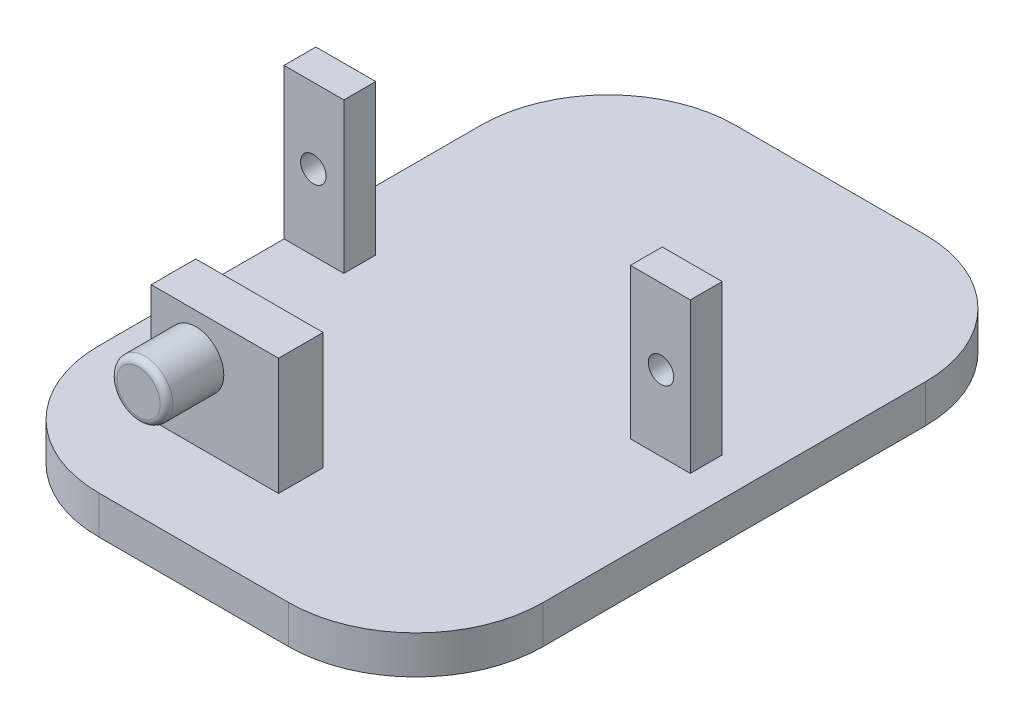
ISO-10303-21;
HEADER;
FILE_DESCRIPTION(('STEP AP214'),'2;1');
FILE_NAME('part.step','',(''),(''),'','','');
FILE_SCHEMA(('AUTOMOTIVE_DESIGN { 1 0 10303 214 1 1 1 1 }'));
ENDSEC;
DATA;
#1=APPLICATION_CONTEXT('core data for automotive mechanical design processes');
#2=APPLICATION_PROTOCOL_DEFINITION('international standard','automotive_design',2000,#1);
#3=PRODUCT_CONTEXT('',#1,'mechanical');
#4=PRODUCT('Part','Part','',(#3));
#5=PRODUCT_RELATED_PRODUCT_CATEGORY('part','',(#4));
#6=PRODUCT_DEFINITION_FORMATION('','',#4);
#7=PRODUCT_DEFINITION_CONTEXT('part definition',#1,'design');
#8=PRODUCT_DEFINITION('design','',#6,#7);
#9=PRODUCT_DEFINITION_SHAPE('','',#8);
#10=(LENGTH_UNIT() NAMED_UNIT(*) SI_UNIT(.MILLI.,.METRE.));
#11=(NAMED_UNIT(*) PLANE_ANGLE_UNIT() SI_UNIT($,.RADIAN.));
#12=(NAMED_UNIT(*) SI_UNIT($,.STERADIAN.) SOLID_ANGLE_UNIT());
#13=UNCERTAINTY_MEASURE_WITH_UNIT(LENGTH_MEASURE(1.E-05),#10,'distance_accuracy_value','');
#14=(GEOMETRIC_REPRESENTATION_CONTEXT(3) GLOBAL_UNCERTAINTY_ASSIGNED_CONTEXT((#13)) GLOBAL_UNIT_ASSIGNED_CONTEXT((#10,
#11,#12)) REPRESENTATION_CONTEXT('',''));
#15=CARTESIAN_POINT('',(0.,0.,0.));
#16=DIRECTION('',(0.,0.,1.));
#17=DIRECTION('',(1.,0.,0.));
#18=AXIS2_PLACEMENT_3D('',#15,#16,#17);
#19=CARTESIAN_POINT('',(0.,3.,-50.));
#20=DIRECTION('',(0.,-1.,0.));
#21=DIRECTION('',(0.,0.,1.));
#22=AXIS2_PLACEMENT_3D('',#19,#20,#21);
#23=PLANE('',#22);
#24=DIRECTION('',(0.,0.,1.));
#25=VECTOR('',#24,1.);
#26=CARTESIAN_POINT('',(27.2,3.,-27.05));
#27=LINE('',#26,#25);
#28=CARTESIAN_POINT('',(27.2,3.,-27.05));
#29=VERTEX_POINT('',#28);
#30=CARTESIAN_POINT('',(27.2,3.,-24.55));
#31=VERTEX_POINT('',#30);
#32=EDGE_CURVE('E178',#29,#31,#27,.T.);
#33=ORIENTED_EDGE('',*,*,#32,.F.);
#34=DIRECTION('',(1.,0.,0.));
#35=VECTOR('',#34,1.);
#36=CARTESIAN_POINT('',(27.2,3.,-27.05));
#37=LINE('',#36,#35);
#38=CARTESIAN_POINT('',(31.9,3.,-27.05));
#39=VERTEX_POINT('',#38);
#40=EDGE_CURVE('E197',#29,#39,#37,.T.);
#41=ORIENTED_EDGE('',*,*,#40,.T.);
#42=DIRECTION('',(0.,0.,1.));
#43=VECTOR('',#42,1.);
#44=CARTESIAN_POINT('',(31.9,3.,-27.05));
#45=LINE('',#44,#43);
#46=CARTESIAN_POINT('',(31.9,3.,-24.55));
#47=VERTEX_POINT('',#46);
#48=EDGE_CURVE('E208',#39,#47,#45,.T.);
#49=ORIENTED_EDGE('',*,*,#48,.T.);
#50=DIRECTION('',(1.,0.,0.));
#51=VECTOR('',#50,1.);
#52=CARTESIAN_POINT('',(27.2,3.,-24.55));
#53=LINE('',#52,#51);
#54=EDGE_CURVE('E191',#31,#47,#53,.T.);
#55=ORIENTED_EDGE('',*,*,#54,.F.);
#56=EDGE_LOOP('',(#33,#41,#49,#55));
#57=FACE_BOUND('',#56,.T.);
#58=DIRECTION('',(-1.,0.,0.));
#59=VECTOR('',#58,1.);
#60=CARTESIAN_POINT('',(0.,3.,-50.));
#61=LINE('',#60,#59);
#62=CARTESIAN_POINT('',(24.9,3.,-50.));
#63=VERTEX_POINT('',#62);
#64=CARTESIAN_POINT('',(10.,3.,-50.));
#65=VERTEX_POINT('',#64);
#66=EDGE_CURVE('E273',#63,#65,#61,.T.);
#67=ORIENTED_EDGE('',*,*,#66,.T.);
#68=CARTESIAN_POINT('',(10.,3.,-40.));
#69=DIRECTION('',(0.,1.,0.));
#70=DIRECTION('',(0.,0.,1.));
#71=AXIS2_PLACEMENT_3D('',#68,#69,#70);
#72=CIRCLE('',#71,10.);
#73=CARTESIAN_POINT('',(0.,3.,-40.));
#74=VERTEX_POINT('',#73);
#75=EDGE_CURVE('E307',#74,#65,#72,.F.);
#76=ORIENTED_EDGE('',*,*,#75,.F.);
#77=DIRECTION('',(0.,0.,1.));
#78=VECTOR('',#77,1.);
#79=CARTESIAN_POINT('',(0.,3.,-50.));
#80=LINE('',#79,#78);
#81=CARTESIAN_POINT('',(0.,3.,-27.05));
#82=VERTEX_POINT('',#81);
#83=EDGE_CURVE('E282',#74,#82,#80,.T.);
#84=ORIENTED_EDGE('',*,*,#83,.T.);
#85=DIRECTION('',(-1.,0.,0.));
#86=VECTOR('',#85,1.);
#87=CARTESIAN_POINT('',(4.7,3.,-27.05));
#88=LINE('',#87,#86);
#89=CARTESIAN_POINT('',(4.7,3.,-27.05));
#90=VERTEX_POINT('',#89);
#91=EDGE_CURVE('E212',#90,#82,#88,.T.);
#92=ORIENTED_EDGE('',*,*,#91,.F.);
#93=DIRECTION('',(0.,0.,1.));
#94=VECTOR('',#93,1.);
#95=CARTESIAN_POINT('',(4.7,3.,-27.05));
#96=LINE('',#95,#94);
#97=CARTESIAN_POINT('',(4.7,3.,-24.55));
#98=VERTEX_POINT('',#97);
#99=EDGE_CURVE('E222',#90,#98,#96,.T.);
#100=ORIENTED_EDGE('',*,*,#99,.T.);
#101=DIRECTION('',(-1.,0.,0.));
#102=VECTOR('',#101,1.);
#103=CARTESIAN_POINT('',(4.7,3.,-24.55));
#104=LINE('',#103,#102);
#105=CARTESIAN_POINT('',(0.,3.,-24.55));
#106=VERTEX_POINT('',#105);
#107=EDGE_CURVE('E217',#98,#106,#104,.T.);
#108=ORIENTED_EDGE('',*,*,#107,.T.);
#109=CARTESIAN_POINT('',(0.,3.,-10.));
#110=VERTEX_POINT('',#109);
#111=EDGE_CURVE('E277',#106,#110,#80,.T.);
#112=ORIENTED_EDGE('',*,*,#111,.T.);
#113=CARTESIAN_POINT('',(10.,3.,-10.));
#114=DIRECTION('',(0.,1.,0.));
#115=DIRECTION('',(0.,0.,1.));
#116=AXIS2_PLACEMENT_3D('',#113,#114,#115);
#117=CIRCLE('',#116,10.);
#118=CARTESIAN_POINT('',(10.,3.,0.));
#119=VERTEX_POINT('',#118);
#120=EDGE_CURVE('E310',#119,#110,#117,.F.);
#121=ORIENTED_EDGE('',*,*,#120,.F.);
#122=DIRECTION('',(-1.,0.,0.));
#123=VECTOR('',#122,1.);
#124=CARTESIAN_POINT('',(0.,3.,0.));
#125=LINE('',#124,#123);
#126=CARTESIAN_POINT('',(24.9,3.,0.));
#127=VERTEX_POINT('',#126);
#128=EDGE_CURVE('E274',#127,#119,#125,.T.);
#129=ORIENTED_EDGE('',*,*,#128,.F.);
#130=CARTESIAN_POINT('',(24.9,3.,-10.));
#131=DIRECTION('',(0.,1.,0.));
#132=DIRECTION('',(0.,0.,1.));
#133=AXIS2_PLACEMENT_3D('',#130,#131,#132);
#134=CIRCLE('',#133,10.);
#135=CARTESIAN_POINT('',(34.9,3.,-10.));
#136=VERTEX_POINT('',#135);
#137=EDGE_CURVE('E313',#136,#127,#134,.F.);
#138=ORIENTED_EDGE('',*,*,#137,.F.);
#139=DIRECTION('',(0.,0.,1.));
#140=VECTOR('',#139,1.);
#141=CARTESIAN_POINT('',(34.9,3.,-50.));
#142=LINE('',#141,#140);
#143=CARTESIAN_POINT('',(34.9,3.,-40.));
#144=VERTEX_POINT('',#143);
#145=EDGE_CURVE('E285',#144,#136,#142,.T.);
#146=ORIENTED_EDGE('',*,*,#145,.F.);
#147=CARTESIAN_POINT('',(24.9,3.,-40.));
#148=DIRECTION('',(0.,1.,0.));
#149=DIRECTION('',(0.,0.,1.));
#150=AXIS2_PLACEMENT_3D('',#147,#148,#149);
#151=CIRCLE('',#150,10.);
#152=EDGE_CURVE('E316',#63,#144,#151,.F.);
#153=ORIENTED_EDGE('',*,*,#152,.F.);
#154=EDGE_LOOP('',(#67,#76,#84,#92,#100,#108,#112,#121,#129,#138,#146,#153));
#155=FACE_BOUND('',#154,.T.);
#156=DIRECTION('',(0.,0.,1.));
#157=VECTOR('',#156,1.);
#158=CARTESIAN_POINT('',(17.1,3.,-10.52));
#159=LINE('',#158,#157);
#160=CARTESIAN_POINT('',(17.1,3.,-10.52));
#161=VERTEX_POINT('',#160);
#162=CARTESIAN_POINT('',(17.1,3.,-7.02));
#163=VERTEX_POINT('',#162);
#164=EDGE_CURVE('E225',#161,#163,#159,.T.);
#165=ORIENTED_EDGE('',*,*,#164,.T.);
#166=DIRECTION('',(-1.,0.,0.));
#167=VECTOR('',#166,1.);
#168=CARTESIAN_POINT('',(17.1,3.,-7.02));
#169=LINE('',#168,#167);
#170=CARTESIAN_POINT('',(7.1,3.,-7.02000000000001));
#171=VERTEX_POINT('',#170);
#172=EDGE_CURVE('E254',#163,#171,#169,.T.);
#173=ORIENTED_EDGE('',*,*,#172,.T.);
#174=DIRECTION('',(0.,0.,1.));
#175=VECTOR('',#174,1.);
#176=CARTESIAN_POINT('',(7.1,3.,-10.52));
#177=LINE('',#176,#175);
#178=CARTESIAN_POINT('',(7.1,3.,-10.52));
#179=VERTEX_POINT('',#178);
#180=EDGE_CURVE('E257',#179,#171,#177,.T.);
#181=ORIENTED_EDGE('',*,*,#180,.F.);
#182=DIRECTION('',(-1.,0.,0.));
#183=VECTOR('',#182,1.);
#184=CARTESIAN_POINT('',(17.1,3.,-10.52));
#185=LINE('',#184,#183);
#186=EDGE_CURVE('E244',#161,#179,#185,.T.);
#187=ORIENTED_EDGE('',*,*,#186,.F.);
#188=EDGE_LOOP('',(#165,#173,#181,#187));
#189=FACE_BOUND('',#188,.T.);
#190=ADVANCED_FACE('F35',(#57,#155,#189),#23,.F.);
#191=CARTESIAN_POINT('',(0.,0.,-50.));
#192=DIRECTION('',(1.,0.,0.));
#193=DIRECTION('',(0.,0.,1.));
#194=AXIS2_PLACEMENT_3D('',#191,#192,#193);
#195=PLANE('',#194);
#196=ORIENTED_EDGE('',*,*,#111,.F.);
#197=DIRECTION('',(0.,-1.,0.));
#198=VECTOR('',#197,1.);
#199=CARTESIAN_POINT('',(0.,20.1235326616825,-24.55));
#200=LINE('',#199,#198);
#201=CARTESIAN_POINT('',(0.,14.8,-24.55));
#202=VERTEX_POINT('',#201);
#203=EDGE_CURVE('E235',#202,#106,#200,.T.);
#204=ORIENTED_EDGE('',*,*,#203,.F.);
#205=DIRECTION('',(0.,0.,1.));
#206=VECTOR('',#205,1.);
#207=CARTESIAN_POINT('',(0.,14.8,-27.05));
#208=LINE('',#207,#206);
#209=CARTESIAN_POINT('',(0.,14.8,-27.05));
#210=VERTEX_POINT('',#209);
#211=EDGE_CURVE('E232',#210,#202,#208,.T.);
#212=ORIENTED_EDGE('',*,*,#211,.F.);
#213=DIRECTION('',(0.,-1.,0.));
#214=VECTOR('',#213,1.);
#215=CARTESIAN_POINT('',(0.,20.1235326616825,-27.05));
#216=LINE('',#215,#214);
#217=EDGE_CURVE('E227',#210,#82,#216,.T.);
#218=ORIENTED_EDGE('',*,*,#217,.T.);
#219=ORIENTED_EDGE('',*,*,#83,.F.);
#220=DIRECTION('',(0.,-1.,0.));
#221=VECTOR('',#220,1.);
#222=CARTESIAN_POINT('',(0.,0.,-40.));
#223=LINE('',#222,#221);
#224=CARTESIAN_POINT('',(0.,0.,-40.));
#225=VERTEX_POINT('',#224);
#226=EDGE_CURVE('E43',#225,#74,#223,.F.);
#227=ORIENTED_EDGE('',*,*,#226,.F.);
#228=DIRECTION('',(0.,0.,1.));
#229=VECTOR('',#228,1.);
#230=CARTESIAN_POINT('',(0.,0.,-50.));
#231=LINE('',#230,#229);
#232=CARTESIAN_POINT('',(0.,0.,-10.));
#233=VERTEX_POINT('',#232);
#234=EDGE_CURVE('E291',#225,#233,#231,.T.);
#235=ORIENTED_EDGE('',*,*,#234,.T.);
#236=DIRECTION('',(0.,-1.,0.));
#237=VECTOR('',#236,1.);
#238=CARTESIAN_POINT('',(0.,0.,-10.));
#239=LINE('',#238,#237);
#240=EDGE_CURVE('E11',#110,#233,#239,.T.);
#241=ORIENTED_EDGE('',*,*,#240,.F.);
#242=EDGE_LOOP('',(#196,#204,#212,#218,#219,#227,#235,#241));
#243=FACE_BOUND('',#242,.T.);
#244=ADVANCED_FACE('F339',(#243),#195,.F.);
#245=CARTESIAN_POINT('',(0.,0.,-50.));
#246=DIRECTION('',(0.,1.,0.));
#247=DIRECTION('',(0.,0.,-1.));
#248=AXIS2_PLACEMENT_3D('',#245,#246,#247);
#249=PLANE('',#248);
#250=DIRECTION('',(0.,0.,1.));
#251=VECTOR('',#250,1.);
#252=CARTESIAN_POINT('',(34.9,0.,-50.));
#253=LINE('',#252,#251);
#254=CARTESIAN_POINT('',(34.9,0.,-40.));
#255=VERTEX_POINT('',#254);
#256=CARTESIAN_POINT('',(34.9,0.,-10.));
#257=VERTEX_POINT('',#256);
#258=EDGE_CURVE('E288',#255,#257,#253,.T.);
#259=ORIENTED_EDGE('',*,*,#258,.T.);
#260=CARTESIAN_POINT('',(24.9,0.,-10.));
#261=DIRECTION('',(0.,-1.,0.));
#262=DIRECTION('',(0.,0.,-1.));
#263=AXIS2_PLACEMENT_3D('',#260,#261,#262);
#264=CIRCLE('',#263,10.);
#265=CARTESIAN_POINT('',(24.9,0.,0.));
#266=VERTEX_POINT('',#265);
#267=EDGE_CURVE('E325',#266,#257,#264,.F.);
#268=ORIENTED_EDGE('',*,*,#267,.F.);
#269=DIRECTION('',(1.,0.,0.));
#270=VECTOR('',#269,1.);
#271=CARTESIAN_POINT('',(0.,0.,0.));
#272=LINE('',#271,#270);
#273=CARTESIAN_POINT('',(10.,0.,0.));
#274=VERTEX_POINT('',#273);
#275=EDGE_CURVE('E269',#274,#266,#272,.T.);
#276=ORIENTED_EDGE('',*,*,#275,.F.);
#277=CARTESIAN_POINT('',(10.,0.,-10.));
#278=DIRECTION('',(0.,-1.,0.));
#279=DIRECTION('',(0.,0.,-1.));
#280=AXIS2_PLACEMENT_3D('',#277,#278,#279);
#281=CIRCLE('',#280,10.);
#282=EDGE_CURVE('E50',#233,#274,#281,.F.);
#283=ORIENTED_EDGE('',*,*,#282,.F.);
#284=ORIENTED_EDGE('',*,*,#234,.F.);
#285=CARTESIAN_POINT('',(10.,0.,-40.));
#286=DIRECTION('',(0.,-1.,0.));
#287=DIRECTION('',(0.,0.,-1.));
#288=AXIS2_PLACEMENT_3D('',#285,#286,#287);
#289=CIRCLE('',#288,10.);
#290=CARTESIAN_POINT('',(10.,0.,-50.));
#291=VERTEX_POINT('',#290);
#292=EDGE_CURVE('E57',#291,#225,#289,.F.);
#293=ORIENTED_EDGE('',*,*,#292,.F.);
#294=DIRECTION('',(1.,0.,0.));
#295=VECTOR('',#294,1.);
#296=CARTESIAN_POINT('',(0.,0.,-50.));
#297=LINE('',#296,#295);
#298=CARTESIAN_POINT('',(24.9,0.,-50.));
#299=VERTEX_POINT('',#298);
#300=EDGE_CURVE('E270',#291,#299,#297,.T.);
#301=ORIENTED_EDGE('',*,*,#300,.T.);
#302=CARTESIAN_POINT('',(24.9,0.,-40.));
#303=DIRECTION('',(0.,-1.,0.));
#304=DIRECTION('',(0.,0.,-1.));
#305=AXIS2_PLACEMENT_3D('',#302,#303,#304);
#306=CIRCLE('',#305,10.);
#307=EDGE_CURVE('E328',#255,#299,#306,.F.);
#308=ORIENTED_EDGE('',*,*,#307,.F.);
#309=EDGE_LOOP('',(#259,#268,#276,#283,#284,#293,#301,#308));
#310=FACE_BOUND('',#309,.T.);
#311=ADVANCED_FACE('F352',(#310),#249,.F.);
#312=CARTESIAN_POINT('',(34.9,0.,-50.));
#313=DIRECTION('',(-1.,0.,0.));
#314=DIRECTION('',(0.,0.,-1.));
#315=AXIS2_PLACEMENT_3D('',#312,#313,#314);
#316=PLANE('',#315);
#317=ORIENTED_EDGE('',*,*,#145,.T.);
#318=DIRECTION('',(0.,1.,0.));
#319=VECTOR('',#318,1.);
#320=CARTESIAN_POINT('',(34.9,3.,-10.));
#321=LINE('',#320,#319);
#322=EDGE_CURVE('E319',#257,#136,#321,.T.);
#323=ORIENTED_EDGE('',*,*,#322,.F.);
#324=ORIENTED_EDGE('',*,*,#258,.F.);
#325=DIRECTION('',(0.,1.,0.));
#326=VECTOR('',#325,1.);
#327=CARTESIAN_POINT('',(34.9,0.,-40.));
#328=LINE('',#327,#326);
#329=EDGE_CURVE('E321',#144,#255,#328,.F.);
#330=ORIENTED_EDGE('',*,*,#329,.F.);
#331=EDGE_LOOP('',(#317,#323,#324,#330));
#332=FACE_BOUND('',#331,.T.);
#333=ADVANCED_FACE('F393',(#332),#316,.F.);
#334=CARTESIAN_POINT('',(0.,0.,-50.));
#335=DIRECTION('',(0.,0.,1.));
#336=DIRECTION('',(-1.,0.,0.));
#337=AXIS2_PLACEMENT_3D('',#334,#335,#336);
#338=PLANE('',#337);
#339=ORIENTED_EDGE('',*,*,#300,.F.);
#340=DIRECTION('',(0.,-1.,0.));
#341=VECTOR('',#340,1.);
#342=CARTESIAN_POINT('',(10.,0.,-50.));
#343=LINE('',#342,#341);
#344=EDGE_CURVE('E303',#65,#291,#343,.T.);
#345=ORIENTED_EDGE('',*,*,#344,.F.);
#346=ORIENTED_EDGE('',*,*,#66,.F.);
#347=DIRECTION('',(0.,1.,0.));
#348=VECTOR('',#347,1.);
#349=CARTESIAN_POINT('',(24.9,0.,-50.));
#350=LINE('',#349,#348);
#351=EDGE_CURVE('E305',#299,#63,#350,.T.);
#352=ORIENTED_EDGE('',*,*,#351,.F.);
#353=EDGE_LOOP('',(#339,#345,#346,#352));
#354=FACE_BOUND('',#353,.T.);
#355=ADVANCED_FACE('F350',(#354),#338,.F.);
#356=CARTESIAN_POINT('',(0.,0.,0.));
#357=DIRECTION('',(0.,0.,1.));
#358=DIRECTION('',(-1.,0.,0.));
#359=AXIS2_PLACEMENT_3D('',#356,#357,#358);
#360=PLANE('',#359);
#361=ORIENTED_EDGE('',*,*,#128,.T.);
#362=DIRECTION('',(0.,-1.,0.));
#363=VECTOR('',#362,1.);
#364=CARTESIAN_POINT('',(10.,3.,0.));
#365=LINE('',#364,#363);
#366=EDGE_CURVE('E331',#274,#119,#365,.F.);
#367=ORIENTED_EDGE('',*,*,#366,.F.);
#368=ORIENTED_EDGE('',*,*,#275,.T.);
#369=DIRECTION('',(0.,1.,0.));
#370=VECTOR('',#369,1.);
#371=CARTESIAN_POINT('',(24.9,0.,0.));
#372=LINE('',#371,#370);
#373=EDGE_CURVE('E333',#127,#266,#372,.F.);
#374=ORIENTED_EDGE('',*,*,#373,.F.);
#375=EDGE_LOOP('',(#361,#367,#368,#374));
#376=FACE_BOUND('',#375,.T.);
#377=ADVANCED_FACE('F391',(#376),#360,.T.);
#378=CARTESIAN_POINT('',(17.1,12.2,-10.52));
#379=DIRECTION('',(-1.,0.,0.));
#380=DIRECTION('',(0.,0.,-1.));
#381=AXIS2_PLACEMENT_3D('',#378,#379,#380);
#382=PLANE('',#381);
#383=ORIENTED_EDGE('',*,*,#164,.F.);
#384=DIRECTION('',(0.,-1.,0.));
#385=VECTOR('',#384,1.);
#386=CARTESIAN_POINT('',(17.1,12.2,-10.52));
#387=LINE('',#386,#385);
#388=CARTESIAN_POINT('',(17.1,12.2,-10.52));
#389=VERTEX_POINT('',#388);
#390=EDGE_CURVE('E251',#389,#161,#387,.T.);
#391=ORIENTED_EDGE('',*,*,#390,.F.);
#392=DIRECTION('',(0.,0.,1.));
#393=VECTOR('',#392,1.);
#394=CARTESIAN_POINT('',(17.1,12.2,-10.52));
#395=LINE('',#394,#393);
#396=CARTESIAN_POINT('',(17.1,12.2,-7.02));
#397=VERTEX_POINT('',#396);
#398=EDGE_CURVE('E240',#389,#397,#395,.T.);
#399=ORIENTED_EDGE('',*,*,#398,.T.);
#400=DIRECTION('',(0.,-1.,0.));
#401=VECTOR('',#400,1.);
#402=CARTESIAN_POINT('',(17.1,12.2,-7.02));
#403=LINE('',#402,#401);
#404=EDGE_CURVE('E267',#397,#163,#403,.T.);
#405=ORIENTED_EDGE('',*,*,#404,.T.);
#406=EDGE_LOOP('',(#383,#391,#399,#405));
#407=FACE_BOUND('',#406,.T.);
#408=ADVANCED_FACE('F587',(#407),#382,.F.);
#409=CARTESIAN_POINT('',(17.1,12.2,-7.02));
#410=DIRECTION('',(0.,0.,-1.));
#411=DIRECTION('',(1.,0.,0.));
#412=AXIS2_PLACEMENT_3D('',#409,#410,#411);
#413=PLANE('',#412);
#414=CARTESIAN_POINT('',(10.6,8.9,-7.02));
#415=DIRECTION('',(0.,0.,1.));
#416=DIRECTION('',(1.,0.,0.));
#417=AXIS2_PLACEMENT_3D('',#414,#415,#416);
#418=CIRCLE('',#417,2.2);
#419=CARTESIAN_POINT('',(12.8,8.9,-7.02));
#420=VERTEX_POINT('',#419);
#421=EDGE_CURVE('E294',#420,#420,#418,.F.);
#422=ORIENTED_EDGE('',*,*,#421,.T.);
#423=EDGE_LOOP('',(#422));
#424=FACE_BOUND('',#423,.T.);
#425=ORIENTED_EDGE('',*,*,#172,.F.);
#426=ORIENTED_EDGE('',*,*,#404,.F.);
#427=DIRECTION('',(-1.,0.,0.));
#428=VECTOR('',#427,1.);
#429=CARTESIAN_POINT('',(17.1,12.2,-7.02));
#430=LINE('',#429,#428);
#431=CARTESIAN_POINT('',(7.1,12.2,-7.02000000000001));
#432=VERTEX_POINT('',#431);
#433=EDGE_CURVE('E243',#397,#432,#430,.T.);
#434=ORIENTED_EDGE('',*,*,#433,.T.);
#435=DIRECTION('',(0.,-1.,0.));
#436=VECTOR('',#435,1.);
#437=CARTESIAN_POINT('',(7.1,12.2,-7.02000000000001));
#438=LINE('',#437,#436);
#439=EDGE_CURVE('E265',#432,#171,#438,.T.);
#440=ORIENTED_EDGE('',*,*,#439,.T.);
#441=EDGE_LOOP('',(#425,#426,#434,#440));
#442=FACE_BOUND('',#441,.T.);
#443=ADVANCED_FACE('F577',(#424,#442),#413,.F.);
#444=CARTESIAN_POINT('',(7.1,12.2,-10.52));
#445=DIRECTION('',(-1.,0.,0.));
#446=DIRECTION('',(0.,0.,-1.));
#447=AXIS2_PLACEMENT_3D('',#444,#445,#446);
#448=PLANE('',#447);
#449=ORIENTED_EDGE('',*,*,#180,.T.);
#450=ORIENTED_EDGE('',*,*,#439,.F.);
#451=DIRECTION('',(0.,0.,1.));
#452=VECTOR('',#451,1.);
#453=CARTESIAN_POINT('',(7.1,12.2,-10.52));
#454=LINE('',#453,#452);
#455=CARTESIAN_POINT('',(7.1,12.2,-10.52));
#456=VERTEX_POINT('',#455);
#457=EDGE_CURVE('E247',#456,#432,#454,.T.);
#458=ORIENTED_EDGE('',*,*,#457,.F.);
#459=DIRECTION('',(0.,-1.,0.));
#460=VECTOR('',#459,1.);
#461=CARTESIAN_POINT('',(7.1,12.2,-10.52));
#462=LINE('',#461,#460);
#463=EDGE_CURVE('E263',#456,#179,#462,.T.);
#464=ORIENTED_EDGE('',*,*,#463,.T.);
#465=EDGE_LOOP('',(#449,#450,#458,#464));
#466=FACE_BOUND('',#465,.T.);
#467=ADVANCED_FACE('F567',(#466),#448,.T.);
#468=CARTESIAN_POINT('',(17.1,12.2,-10.52));
#469=DIRECTION('',(0.,0.,-1.));
#470=DIRECTION('',(1.,0.,0.));
#471=AXIS2_PLACEMENT_3D('',#468,#469,#470);
#472=PLANE('',#471);
#473=ORIENTED_EDGE('',*,*,#186,.T.);
#474=ORIENTED_EDGE('',*,*,#463,.F.);
#475=DIRECTION('',(-1.,0.,0.));
#476=VECTOR('',#475,1.);
#477=CARTESIAN_POINT('',(17.1,12.2,-10.52));
#478=LINE('',#477,#476);
#479=EDGE_CURVE('E249',#389,#456,#478,.T.);
#480=ORIENTED_EDGE('',*,*,#479,.F.);
#481=ORIENTED_EDGE('',*,*,#390,.T.);
#482=EDGE_LOOP('',(#473,#474,#480,#481));
#483=FACE_BOUND('',#482,.T.);
#484=ADVANCED_FACE('F557',(#483),#472,.T.);
#485=CARTESIAN_POINT('',(0.,12.2,0.));
#486=DIRECTION('',(0.,1.,0.));
#487=DIRECTION('',(0.,0.,-1.));
#488=AXIS2_PLACEMENT_3D('',#485,#486,#487);
#489=PLANE('',#488);
#490=ORIENTED_EDGE('',*,*,#398,.F.);
#491=ORIENTED_EDGE('',*,*,#479,.T.);
#492=ORIENTED_EDGE('',*,*,#457,.T.);
#493=ORIENTED_EDGE('',*,*,#433,.F.);
#494=EDGE_LOOP('',(#490,#491,#492,#493));
#495=FACE_BOUND('',#494,.T.);
#496=ADVANCED_FACE('F547',(#495),#489,.T.);
#497=CARTESIAN_POINT('',(10.6,8.9,3.70253967444162));
#498=DIRECTION('',(0.,0.,-1.));
#499=DIRECTION('',(1.,0.,0.));
#500=AXIS2_PLACEMENT_3D('',#497,#498,#499);
#501=CYLINDRICAL_SURFACE('',#500,2.2);
#502=CARTESIAN_POINT('',(10.6,8.9,-3.02));
#503=DIRECTION('',(0.,0.,-1.));
#504=DIRECTION('',(0.,1.,0.));
#505=AXIS2_PLACEMENT_3D('',#502,#503,#504);
#506=CIRCLE('',#505,2.2);
#507=CARTESIAN_POINT('',(10.6,11.1,-3.02));
#508=VERTEX_POINT('',#507);
#509=EDGE_CURVE('E300',#508,#508,#506,.F.);
#510=ORIENTED_EDGE('',*,*,#509,.F.);
#511=EDGE_LOOP('',(#510));
#512=FACE_BOUND('',#511,.T.);
#513=ORIENTED_EDGE('',*,*,#421,.F.);
#514=EDGE_LOOP('',(#513));
#515=FACE_BOUND('',#514,.T.);
#516=ADVANCED_FACE('F537',(#512,#515),#501,.T.);
#517=CARTESIAN_POINT('',(5.59999999999999,5.60000000000002,-2.51999999999999));
#518=DIRECTION('',(0.,0.,1.));
#519=DIRECTION('',(0.,1.,0.));
#520=AXIS2_PLACEMENT_3D('',#517,#518,#519);
#521=PLANE('',#520);
#522=CARTESIAN_POINT('',(10.6,8.9,-2.52));
#523=DIRECTION('',(0.,0.,-1.));
#524=DIRECTION('',(0.,1.,0.));
#525=AXIS2_PLACEMENT_3D('',#522,#523,#524);
#526=CIRCLE('',#525,1.7);
#527=CARTESIAN_POINT('',(10.6,10.6,-2.52));
#528=VERTEX_POINT('',#527);
#529=EDGE_CURVE('E297',#528,#528,#526,.T.);
#530=ORIENTED_EDGE('',*,*,#529,.F.);
#531=EDGE_LOOP('',(#530));
#532=FACE_BOUND('',#531,.T.);
#533=ADVANCED_FACE('F402',(#532),#521,.T.);
#534=CARTESIAN_POINT('',(10.6,8.9,-3.02));
#535=DIRECTION('',(0.,0.,1.));
#536=DIRECTION('',(0.,1.,0.));
#537=AXIS2_PLACEMENT_3D('',#534,#535,#536);
#538=TOROIDAL_SURFACE('',#537,1.7,0.5);
#539=ORIENTED_EDGE('',*,*,#509,.T.);
#540=EDGE_LOOP('',(#539));
#541=FACE_BOUND('',#540,.T.);
#542=ORIENTED_EDGE('',*,*,#529,.T.);
#543=EDGE_LOOP('',(#542));
#544=FACE_BOUND('',#543,.T.);
#545=ADVANCED_FACE('F399',(#541,#544),#538,.T.);
#546=CARTESIAN_POINT('',(27.2,14.8,-11.15));
#547=DIRECTION('',(0.,1.,0.));
#548=DIRECTION('',(-1.,0.,0.));
#549=AXIS2_PLACEMENT_3D('',#546,#547,#548);
#550=PLANE('',#549);
#551=DIRECTION('',(-1.,0.,0.));
#552=VECTOR('',#551,1.);
#553=CARTESIAN_POINT('',(4.7,14.8,-27.05));
#554=LINE('',#553,#552);
#555=CARTESIAN_POINT('',(4.7,14.8,-27.05));
#556=VERTEX_POINT('',#555);
#557=EDGE_CURVE('E215',#556,#210,#554,.T.);
#558=ORIENTED_EDGE('',*,*,#557,.T.);
#559=ORIENTED_EDGE('',*,*,#211,.T.);
#560=DIRECTION('',(-1.,0.,0.));
#561=VECTOR('',#560,1.);
#562=CARTESIAN_POINT('',(4.7,14.8,-24.55));
#563=LINE('',#562,#561);
#564=CARTESIAN_POINT('',(4.7,14.8,-24.55));
#565=VERTEX_POINT('',#564);
#566=EDGE_CURVE('E216',#565,#202,#563,.T.);
#567=ORIENTED_EDGE('',*,*,#566,.F.);
#568=DIRECTION('',(0.,0.,1.));
#569=VECTOR('',#568,1.);
#570=CARTESIAN_POINT('',(4.7,14.8,-27.05));
#571=LINE('',#570,#569);
#572=EDGE_CURVE('E228',#556,#565,#571,.T.);
#573=ORIENTED_EDGE('',*,*,#572,.F.);
#574=EDGE_LOOP('',(#558,#559,#567,#573));
#575=FACE_BOUND('',#574,.T.);
#576=ADVANCED_FACE('F365',(#575),#550,.T.);
#577=CARTESIAN_POINT('',(4.7,20.1235326616825,-27.05));
#578=DIRECTION('',(0.,0.,-1.));
#579=DIRECTION('',(1.,0.,0.));
#580=AXIS2_PLACEMENT_3D('',#577,#578,#579);
#581=PLANE('',#580);
#582=CARTESIAN_POINT('',(2.30000000000004,8.9,-27.05));
#583=DIRECTION('',(0.,0.,1.));
#584=DIRECTION('',(1.,0.,0.));
#585=AXIS2_PLACEMENT_3D('',#582,#583,#584);
#586=CIRCLE('',#585,1.);
#587=CARTESIAN_POINT('',(3.30000000000004,8.9,-27.05));
#588=VERTEX_POINT('',#587);
#589=EDGE_CURVE('E662',#588,#588,#586,.T.);
#590=ORIENTED_EDGE('',*,*,#589,.T.);
#591=EDGE_LOOP('',(#590));
#592=FACE_BOUND('',#591,.T.);
#593=DIRECTION('',(0.,-1.,0.));
#594=VECTOR('',#593,1.);
#595=CARTESIAN_POINT('',(4.7,20.1235326616825,-27.05));
#596=LINE('',#595,#594);
#597=EDGE_CURVE('E220',#556,#90,#596,.T.);
#598=ORIENTED_EDGE('',*,*,#597,.T.);
#599=ORIENTED_EDGE('',*,*,#91,.T.);
#600=ORIENTED_EDGE('',*,*,#217,.F.);
#601=ORIENTED_EDGE('',*,*,#557,.F.);
#602=EDGE_LOOP('',(#598,#599,#600,#601));
#603=FACE_BOUND('',#602,.T.);
#604=ADVANCED_FACE('F369',(#592,#603),#581,.T.);
#605=CARTESIAN_POINT('',(4.7,20.1235326616825,-24.55));
#606=DIRECTION('',(0.,0.,-1.));
#607=DIRECTION('',(1.,0.,0.));
#608=AXIS2_PLACEMENT_3D('',#605,#606,#607);
#609=PLANE('',#608);
#610=CARTESIAN_POINT('',(2.30000000000004,8.9,-24.55));
#611=DIRECTION('',(0.,0.,1.));
#612=DIRECTION('',(1.,0.,0.));
#613=AXIS2_PLACEMENT_3D('',#610,#611,#612);
#614=CIRCLE('',#613,1.);
#615=CARTESIAN_POINT('',(3.30000000000004,8.9,-24.55));
#616=VERTEX_POINT('',#615);
#617=EDGE_CURVE('E663',#616,#616,#614,.F.);
#618=ORIENTED_EDGE('',*,*,#617,.T.);
#619=EDGE_LOOP('',(#618));
#620=FACE_BOUND('',#619,.T.);
#621=ORIENTED_EDGE('',*,*,#566,.T.);
#622=ORIENTED_EDGE('',*,*,#203,.T.);
#623=ORIENTED_EDGE('',*,*,#107,.F.);
#624=DIRECTION('',(0.,-1.,0.));
#625=VECTOR('',#624,1.);
#626=CARTESIAN_POINT('',(4.7,20.1235326616825,-24.55));
#627=LINE('',#626,#625);
#628=EDGE_CURVE('E221',#565,#98,#627,.T.);
#629=ORIENTED_EDGE('',*,*,#628,.F.);
#630=EDGE_LOOP('',(#621,#622,#623,#629));
#631=FACE_BOUND('',#630,.T.);
#632=ADVANCED_FACE('F362',(#620,#631),#609,.F.);
#633=CARTESIAN_POINT('',(4.7,20.1235326616825,-27.05));
#634=DIRECTION('',(-1.,0.,0.));
#635=DIRECTION('',(0.,0.,-1.));
#636=AXIS2_PLACEMENT_3D('',#633,#634,#635);
#637=PLANE('',#636);
#638=ORIENTED_EDGE('',*,*,#572,.T.);
#639=ORIENTED_EDGE('',*,*,#628,.T.);
#640=ORIENTED_EDGE('',*,*,#99,.F.);
#641=ORIENTED_EDGE('',*,*,#597,.F.);
#642=EDGE_LOOP('',(#638,#639,#640,#641));
#643=FACE_BOUND('',#642,.T.);
#644=ADVANCED_FACE('F371',(#643),#637,.F.);
#645=CARTESIAN_POINT('',(27.2,14.8,-11.15));
#646=DIRECTION('',(0.,1.,0.));
#647=DIRECTION('',(-1.,0.,0.));
#648=AXIS2_PLACEMENT_3D('',#645,#646,#647);
#649=PLANE('',#648);
#650=DIRECTION('',(0.,0.,1.));
#651=VECTOR('',#650,1.);
#652=CARTESIAN_POINT('',(27.2,14.8,-27.05));
#653=LINE('',#652,#651);
#654=CARTESIAN_POINT('',(27.2,14.8,-27.05));
#655=VERTEX_POINT('',#654);
#656=CARTESIAN_POINT('',(27.2,14.8,-24.55));
#657=VERTEX_POINT('',#656);
#658=EDGE_CURVE('E176',#655,#657,#653,.T.);
#659=ORIENTED_EDGE('',*,*,#658,.T.);
#660=DIRECTION('',(1.,0.,0.));
#661=VECTOR('',#660,1.);
#662=CARTESIAN_POINT('',(27.2,14.8,-24.55));
#663=LINE('',#662,#661);
#664=CARTESIAN_POINT('',(31.9,14.8,-24.55));
#665=VERTEX_POINT('',#664);
#666=EDGE_CURVE('E185',#657,#665,#663,.T.);
#667=ORIENTED_EDGE('',*,*,#666,.T.);
#668=DIRECTION('',(0.,0.,1.));
#669=VECTOR('',#668,1.);
#670=CARTESIAN_POINT('',(31.9,14.8,-27.05));
#671=LINE('',#670,#669);
#672=CARTESIAN_POINT('',(31.9,14.8,-27.05));
#673=VERTEX_POINT('',#672);
#674=EDGE_CURVE('E206',#673,#665,#671,.T.);
#675=ORIENTED_EDGE('',*,*,#674,.F.);
#676=DIRECTION('',(1.,0.,0.));
#677=VECTOR('',#676,1.);
#678=CARTESIAN_POINT('',(27.2,14.8,-27.05));
#679=LINE('',#678,#677);
#680=EDGE_CURVE('E196',#655,#673,#679,.T.);
#681=ORIENTED_EDGE('',*,*,#680,.F.);
#682=EDGE_LOOP('',(#659,#667,#675,#681));
#683=FACE_BOUND('',#682,.T.);
#684=ADVANCED_FACE('F194',(#683),#649,.T.);
#685=CARTESIAN_POINT('',(27.2,20.1235326616825,-24.55));
#686=DIRECTION('',(0.,0.,1.));
#687=DIRECTION('',(-1.,0.,0.));
#688=AXIS2_PLACEMENT_3D('',#685,#686,#687);
#689=PLANE('',#688);
#690=CARTESIAN_POINT('',(29.6,8.9,-24.55));
#691=DIRECTION('',(0.,0.,-1.));
#692=DIRECTION('',(-1.,0.,0.));
#693=AXIS2_PLACEMENT_3D('',#690,#691,#692);
#694=CIRCLE('',#693,0.999999999999998);
#695=CARTESIAN_POINT('',(28.6,8.9,-24.55));
#696=VERTEX_POINT('',#695);
#697=EDGE_CURVE('E666',#696,#696,#694,.F.);
#698=ORIENTED_EDGE('',*,*,#697,.F.);
#699=EDGE_LOOP('',(#698));
#700=FACE_BOUND('',#699,.T.);
#701=DIRECTION('',(0.,-1.,0.));
#702=VECTOR('',#701,1.);
#703=CARTESIAN_POINT('',(27.2,20.1235326616825,-24.55));
#704=LINE('',#703,#702);
#705=EDGE_CURVE('E172',#657,#31,#704,.T.);
#706=ORIENTED_EDGE('',*,*,#705,.T.);
#707=ORIENTED_EDGE('',*,*,#54,.T.);
#708=DIRECTION('',(0.,-1.,0.));
#709=VECTOR('',#708,1.);
#710=CARTESIAN_POINT('',(31.9,20.1235326616825,-24.55));
#711=LINE('',#710,#709);
#712=EDGE_CURVE('E187',#665,#47,#711,.T.);
#713=ORIENTED_EDGE('',*,*,#712,.F.);
#714=ORIENTED_EDGE('',*,*,#666,.F.);
#715=EDGE_LOOP('',(#706,#707,#713,#714));
#716=FACE_BOUND('',#715,.T.);
#717=ADVANCED_FACE('F186',(#700,#716),#689,.T.);
#718=CARTESIAN_POINT('',(31.9,20.1235326616825,-27.05));
#719=DIRECTION('',(-1.,0.,0.));
#720=DIRECTION('',(0.,0.,-1.));
#721=AXIS2_PLACEMENT_3D('',#718,#719,#720);
#722=PLANE('',#721);
#723=ORIENTED_EDGE('',*,*,#674,.T.);
#724=ORIENTED_EDGE('',*,*,#712,.T.);
#725=ORIENTED_EDGE('',*,*,#48,.F.);
#726=DIRECTION('',(0.,-1.,0.));
#727=VECTOR('',#726,1.);
#728=CARTESIAN_POINT('',(31.9,20.1235326616825,-27.05));
#729=LINE('',#728,#727);
#730=EDGE_CURVE('E210',#673,#39,#729,.T.);
#731=ORIENTED_EDGE('',*,*,#730,.F.);
#732=EDGE_LOOP('',(#723,#724,#725,#731));
#733=FACE_BOUND('',#732,.T.);
#734=ADVANCED_FACE('F470',(#733),#722,.F.);
#735=CARTESIAN_POINT('',(27.2,20.1235326616825,-27.05));
#736=DIRECTION('',(0.,0.,1.));
#737=DIRECTION('',(-1.,0.,0.));
#738=AXIS2_PLACEMENT_3D('',#735,#736,#737);
#739=PLANE('',#738);
#740=CARTESIAN_POINT('',(29.6,8.9,-27.05));
#741=DIRECTION('',(0.,0.,1.));
#742=DIRECTION('',(1.,0.,0.));
#743=AXIS2_PLACEMENT_3D('',#740,#741,#742);
#744=CIRCLE('',#743,0.999999999999998);
#745=CARTESIAN_POINT('',(30.6,8.9,-27.05));
#746=VERTEX_POINT('',#745);
#747=EDGE_CURVE('E182',#746,#746,#744,.T.);
#748=ORIENTED_EDGE('',*,*,#747,.T.);
#749=EDGE_LOOP('',(#748));
#750=FACE_BOUND('',#749,.T.);
#751=ORIENTED_EDGE('',*,*,#680,.T.);
#752=ORIENTED_EDGE('',*,*,#730,.T.);
#753=ORIENTED_EDGE('',*,*,#40,.F.);
#754=DIRECTION('',(0.,-1.,0.));
#755=VECTOR('',#754,1.);
#756=CARTESIAN_POINT('',(27.2,20.1235326616825,-27.05));
#757=LINE('',#756,#755);
#758=EDGE_CURVE('E200',#655,#29,#757,.T.);
#759=ORIENTED_EDGE('',*,*,#758,.F.);
#760=EDGE_LOOP('',(#751,#752,#753,#759));
#761=FACE_BOUND('',#760,.T.);
#762=ADVANCED_FACE('F462',(#750,#761),#739,.F.);
#763=CARTESIAN_POINT('',(27.2,20.1235326616825,-27.05));
#764=DIRECTION('',(-1.,0.,0.));
#765=DIRECTION('',(0.,0.,-1.));
#766=AXIS2_PLACEMENT_3D('',#763,#764,#765);
#767=PLANE('',#766);
#768=ORIENTED_EDGE('',*,*,#758,.T.);
#769=ORIENTED_EDGE('',*,*,#32,.T.);
#770=ORIENTED_EDGE('',*,*,#705,.F.);
#771=ORIENTED_EDGE('',*,*,#658,.F.);
#772=EDGE_LOOP('',(#768,#769,#770,#771));
#773=FACE_BOUND('',#772,.T.);
#774=ADVANCED_FACE('F174',(#773),#767,.T.);
#775=CARTESIAN_POINT('',(29.6,8.9,0.001000000000001));
#776=DIRECTION('',(0.,0.,-1.));
#777=DIRECTION('',(1.,0.,0.));
#778=AXIS2_PLACEMENT_3D('',#775,#776,#777);
#779=CYLINDRICAL_SURFACE('',#778,0.999999999999998);
#780=ORIENTED_EDGE('',*,*,#697,.T.);
#781=EDGE_LOOP('',(#780));
#782=FACE_BOUND('',#781,.T.);
#783=ORIENTED_EDGE('',*,*,#747,.F.);
#784=EDGE_LOOP('',(#783));
#785=FACE_BOUND('',#784,.T.);
#786=ADVANCED_FACE('F443',(#782,#785),#779,.F.);
#787=CARTESIAN_POINT('',(2.30000000000004,8.9,0.001000000000001));
#788=DIRECTION('',(0.,0.,-1.));
#789=DIRECTION('',(1.,0.,0.));
#790=AXIS2_PLACEMENT_3D('',#787,#788,#789);
#791=CYLINDRICAL_SURFACE('',#790,1.);
#792=ORIENTED_EDGE('',*,*,#589,.F.);
#793=EDGE_LOOP('',(#792));
#794=FACE_BOUND('',#793,.T.);
#795=ORIENTED_EDGE('',*,*,#617,.F.);
#796=EDGE_LOOP('',(#795));
#797=FACE_BOUND('',#796,.T.);
#798=ADVANCED_FACE('F408',(#794,#797),#791,.F.);
#799=CARTESIAN_POINT('',(24.9,0.,-40.));
#800=DIRECTION('',(0.,1.,0.));
#801=DIRECTION('',(0.,0.,-1.));
#802=AXIS2_PLACEMENT_3D('',#799,#800,#801);
#803=CYLINDRICAL_SURFACE('',#802,10.);
#804=ORIENTED_EDGE('',*,*,#307,.T.);
#805=ORIENTED_EDGE('',*,*,#351,.T.);
#806=ORIENTED_EDGE('',*,*,#152,.T.);
#807=ORIENTED_EDGE('',*,*,#329,.T.);
#808=EDGE_LOOP('',(#804,#805,#806,#807));
#809=FACE_BOUND('',#808,.T.);
#810=ADVANCED_FACE('F404',(#809),#803,.T.);
#811=CARTESIAN_POINT('',(24.9,0.,-10.));
#812=DIRECTION('',(0.,-1.,0.));
#813=DIRECTION('',(0.,0.,1.));
#814=AXIS2_PLACEMENT_3D('',#811,#812,#813);
#815=CYLINDRICAL_SURFACE('',#814,10.);
#816=ORIENTED_EDGE('',*,*,#267,.T.);
#817=ORIENTED_EDGE('',*,*,#322,.T.);
#818=ORIENTED_EDGE('',*,*,#137,.T.);
#819=ORIENTED_EDGE('',*,*,#373,.T.);
#820=EDGE_LOOP('',(#816,#817,#818,#819));
#821=FACE_BOUND('',#820,.T.);
#822=ADVANCED_FACE('F407',(#821),#815,.T.);
#823=CARTESIAN_POINT('',(10.,0.,-10.));
#824=DIRECTION('',(0.,1.,0.));
#825=DIRECTION('',(0.,0.,-1.));
#826=AXIS2_PLACEMENT_3D('',#823,#824,#825);
#827=CYLINDRICAL_SURFACE('',#826,10.);
#828=ORIENTED_EDGE('',*,*,#120,.T.);
#829=ORIENTED_EDGE('',*,*,#240,.T.);
#830=ORIENTED_EDGE('',*,*,#282,.T.);
#831=ORIENTED_EDGE('',*,*,#366,.T.);
#832=EDGE_LOOP('',(#828,#829,#830,#831));
#833=FACE_BOUND('',#832,.T.);
#834=ADVANCED_FACE('F357',(#833),#827,.T.);
#835=CARTESIAN_POINT('',(10.,0.,-40.));
#836=DIRECTION('',(0.,-1.,0.));
#837=DIRECTION('',(0.,0.,1.));
#838=AXIS2_PLACEMENT_3D('',#835,#836,#837);
#839=CYLINDRICAL_SURFACE('',#838,10.);
#840=ORIENTED_EDGE('',*,*,#75,.T.);
#841=ORIENTED_EDGE('',*,*,#344,.T.);
#842=ORIENTED_EDGE('',*,*,#292,.T.);
#843=ORIENTED_EDGE('',*,*,#226,.T.);
#844=EDGE_LOOP('',(#840,#841,#842,#843));
#845=FACE_BOUND('',#844,.T.);
#846=ADVANCED_FACE('F37',(#845),#839,.T.);
#847=CLOSED_SHELL('',(#190,#244,#311,#333,#355,#377,#408,#443,#467,#484,#496,#516,#533,#545,
#576,#604,#632,#644,#684,#717,#734,#762,#774,#786,#798,#810,#822,#834,#846));
#848=MANIFOLD_SOLID_BREP('B2',#847);
#849=ADVANCED_BREP_SHAPE_REPRESENTATION('',(#18,#848),#14);
#850=SHAPE_DEFINITION_REPRESENTATION(#9,#849);
ENDSEC;
END-ISO-10303-21;
